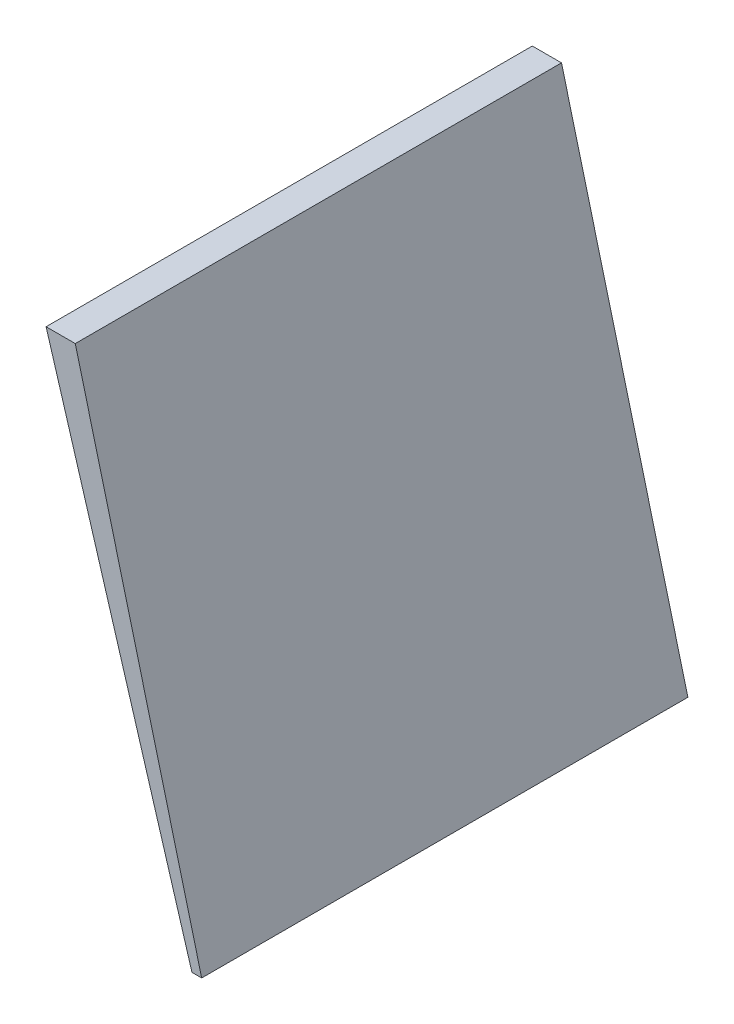
ISO-10303-21;
HEADER;
FILE_DESCRIPTION(('STEP AP214'),'2;1');
FILE_NAME('part.step','',(''),(''),'','','');
FILE_SCHEMA(('AUTOMOTIVE_DESIGN { 1 0 10303 214 1 1 1 1 }'));
ENDSEC;
DATA;
#1=APPLICATION_CONTEXT('core data for automotive mechanical design processes');
#2=APPLICATION_PROTOCOL_DEFINITION('international standard','automotive_design',2000,#1);
#3=PRODUCT_CONTEXT('',#1,'mechanical');
#4=PRODUCT('Part','Part','',(#3));
#5=PRODUCT_RELATED_PRODUCT_CATEGORY('part','',(#4));
#6=PRODUCT_DEFINITION_FORMATION('','',#4);
#7=PRODUCT_DEFINITION_CONTEXT('part definition',#1,'design');
#8=PRODUCT_DEFINITION('design','',#6,#7);
#9=PRODUCT_DEFINITION_SHAPE('','',#8);
#10=(LENGTH_UNIT() NAMED_UNIT(*) SI_UNIT(.MILLI.,.METRE.));
#11=(NAMED_UNIT(*) PLANE_ANGLE_UNIT() SI_UNIT($,.RADIAN.));
#12=(NAMED_UNIT(*) SI_UNIT($,.STERADIAN.) SOLID_ANGLE_UNIT());
#13=UNCERTAINTY_MEASURE_WITH_UNIT(LENGTH_MEASURE(1.E-05),#10,'distance_accuracy_value','');
#14=(GEOMETRIC_REPRESENTATION_CONTEXT(3) GLOBAL_UNCERTAINTY_ASSIGNED_CONTEXT((#13)) GLOBAL_UNIT_ASSIGNED_CONTEXT((#10,
#11,#12)) REPRESENTATION_CONTEXT('',''));
#15=CARTESIAN_POINT('',(0.,0.,0.));
#16=DIRECTION('',(0.,0.,1.));
#17=DIRECTION('',(1.,0.,0.));
#18=AXIS2_PLACEMENT_3D('',#15,#16,#17);
#19=CARTESIAN_POINT('',(-75.91791907794,-2.126384400507,-48.45331843764));
#20=DIRECTION('',(-0.967822506789037,-0.25163385176201,0.));
#21=DIRECTION('',(0.25163385176201,-0.967822506789037,0.));
#22=AXIS2_PLACEMENT_3D('',#19,#20,#21);
#23=PLANE('',#22);
#24=DIRECTION('',(0.251633851761432,-0.967822506789187,0.));
#25=VECTOR('',#24,1.);
#26=CARTESIAN_POINT('',(-76.04791907793,-1.626384400547,-47.25331843764));
#27=LINE('',#26,#25);
#28=CARTESIAN_POINT('',(-76.0479190779294,-1.62638440054749,-47.25331843764));
#29=VERTEX_POINT('',#28);
#30=CARTESIAN_POINT('',(-75.9179190779389,-2.12638440051797,-47.25331843764));
#31=VERTEX_POINT('',#30);
#32=EDGE_CURVE('E66',#29,#31,#27,.T.);
#33=ORIENTED_EDGE('',*,*,#32,.F.);
#34=DIRECTION('',(0.,0.,-1.));
#35=VECTOR('',#34,1.);
#36=CARTESIAN_POINT('',(-76.04791907793,-1.626384400547,-47.92363973764));
#37=LINE('',#36,#35);
#38=CARTESIAN_POINT('',(-76.0479190779269,-1.62638440054749,-46.75331973764));
#39=VERTEX_POINT('',#38);
#40=EDGE_CURVE('E19',#29,#39,#37,.F.);
#41=ORIENTED_EDGE('',*,*,#40,.T.);
#42=DIRECTION('',(-0.25163385174329,0.967822506793904,0.));
#43=VECTOR('',#42,1.);
#44=CARTESIAN_POINT('',(-75.91791907794,-2.126384400516,-46.75331973764));
#45=LINE('',#44,#43);
#46=CARTESIAN_POINT('',(-75.9179190779395,-2.12638440052036,-46.75331973764));
#47=VERTEX_POINT('',#46);
#48=EDGE_CURVE('E80',#47,#39,#45,.T.);
#49=ORIENTED_EDGE('',*,*,#48,.F.);
#50=DIRECTION('',(0.,0.,1.));
#51=VECTOR('',#50,1.);
#52=CARTESIAN_POINT('',(-75.91791907794,-2.126384400525,-44.48106509227));
#53=LINE('',#52,#51);
#54=EDGE_CURVE('E54',#47,#31,#53,.F.);
#55=ORIENTED_EDGE('',*,*,#54,.T.);
#56=EDGE_LOOP('',(#33,#41,#49,#55));
#57=FACE_BOUND('',#56,.T.);
#58=ADVANCED_FACE('F16',(#57),#23,.F.);
#59=CARTESIAN_POINT('',(-66.69522532924,-1.626384400547,-47.92363973764));
#60=DIRECTION('',(0.,-1.,0.));
#61=DIRECTION('',(0.,0.,-1.));
#62=AXIS2_PLACEMENT_3D('',#59,#60,#61);
#63=PLANE('',#62);
#64=DIRECTION('',(-1.,0.,0.));
#65=VECTOR('',#64,1.);
#66=CARTESIAN_POINT('',(0.,-1.626384400547,-47.25331843764));
#67=LINE('',#66,#65);
#68=CARTESIAN_POINT('',(-76.0779190779301,-1.62638440054703,-47.25331843764));
#69=VERTEX_POINT('',#68);
#70=EDGE_CURVE('E61',#69,#29,#67,.F.);
#71=ORIENTED_EDGE('',*,*,#70,.F.);
#72=DIRECTION('',(0.,0.,1.));
#73=VECTOR('',#72,1.);
#74=CARTESIAN_POINT('',(-76.0779190779304,-1.62638440054712,-47.92363973764));
#75=LINE('',#74,#73);
#76=CARTESIAN_POINT('',(-76.0779190779301,-1.62638440054703,-46.75331973764));
#77=VERTEX_POINT('',#76);
#78=EDGE_CURVE('E82',#77,#69,#75,.F.);
#79=ORIENTED_EDGE('',*,*,#78,.F.);
#80=DIRECTION('',(1.,0.,0.));
#81=VECTOR('',#80,1.);
#82=CARTESIAN_POINT('',(-68.59999366419,-1.626384400547,-46.75331973764));
#83=LINE('',#82,#81);
#84=EDGE_CURVE('E64',#39,#77,#83,.F.);
#85=ORIENTED_EDGE('',*,*,#84,.F.);
#86=ORIENTED_EDGE('',*,*,#40,.F.);
#87=EDGE_LOOP('',(#71,#79,#85,#86));
#88=FACE_BOUND('',#87,.T.);
#89=ADVANCED_FACE('F59',(#88),#63,.F.);
#90=CARTESIAN_POINT('',(0.,0.,-47.25331843764));
#91=DIRECTION('',(0.,0.,-1.));
#92=DIRECTION('',(-1.,0.,0.));
#93=AXIS2_PLACEMENT_3D('',#90,#91,#92);
#94=PLANE('',#93);
#95=DIRECTION('',(1.,0.,0.));
#96=VECTOR('',#95,1.);
#97=CARTESIAN_POINT('',(-72.08658338126,-2.126384400525,-47.25331843764));
#98=LINE('',#97,#96);
#99=CARTESIAN_POINT('',(-75.92791907794,-2.12638440051824,-47.25331843764));
#100=VERTEX_POINT('',#99);
#101=EDGE_CURVE('E76',#31,#100,#98,.F.);
#102=ORIENTED_EDGE('',*,*,#101,.T.);
#103=DIRECTION('',(0.28734788556607,-0.957826285221234,0.));
#104=VECTOR('',#103,1.);
#105=CARTESIAN_POINT('',(-75.91240229211,-2.178107019949,-47.25331843764));
#106=LINE('',#105,#104);
#107=EDGE_CURVE('E72',#69,#100,#106,.T.);
#108=ORIENTED_EDGE('',*,*,#107,.F.);
#109=ORIENTED_EDGE('',*,*,#70,.T.);
#110=ORIENTED_EDGE('',*,*,#32,.T.);
#111=EDGE_LOOP('',(#102,#108,#109,#110));
#112=FACE_BOUND('',#111,.T.);
#113=ADVANCED_FACE('F70',(#112),#94,.T.);
#114=CARTESIAN_POINT('',(-72.08658338126,-2.126384400525,-44.48106509227));
#115=DIRECTION('',(0.,1.,0.));
#116=DIRECTION('',(0.,0.,1.));
#117=AXIS2_PLACEMENT_3D('',#114,#115,#116);
#118=PLANE('',#117);
#119=DIRECTION('',(0.,0.,1.));
#120=VECTOR('',#119,1.);
#121=CARTESIAN_POINT('',(-75.9279190779399,-2.12638440051597,-47.92363973764));
#122=LINE('',#121,#120);
#123=CARTESIAN_POINT('',(-75.92791907794,-2.12638440052049,-46.75331973764));
#124=VERTEX_POINT('',#123);
#125=EDGE_CURVE('E25',#100,#124,#122,.T.);
#126=ORIENTED_EDGE('',*,*,#125,.F.);
#127=ORIENTED_EDGE('',*,*,#101,.F.);
#128=ORIENTED_EDGE('',*,*,#54,.F.);
#129=DIRECTION('',(1.,0.,0.));
#130=VECTOR('',#129,1.);
#131=CARTESIAN_POINT('',(-68.59999366419,-2.126384400516,-46.75331973764));
#132=LINE('',#131,#130);
#133=EDGE_CURVE('E34',#124,#47,#132,.T.);
#134=ORIENTED_EDGE('',*,*,#133,.F.);
#135=EDGE_LOOP('',(#126,#127,#128,#134));
#136=FACE_BOUND('',#135,.T.);
#137=ADVANCED_FACE('F88',(#136),#118,.F.);
#138=CARTESIAN_POINT('',(-68.59999366419,-2.201384400604,-46.75331973764));
#139=DIRECTION('',(0.,0.,1.));
#140=DIRECTION('',(1.,0.,0.));
#141=AXIS2_PLACEMENT_3D('',#138,#139,#140);
#142=PLANE('',#141);
#143=ORIENTED_EDGE('',*,*,#133,.T.);
#144=ORIENTED_EDGE('',*,*,#48,.T.);
#145=ORIENTED_EDGE('',*,*,#84,.T.);
#146=DIRECTION('',(0.28734788556607,-0.957826285221234,0.));
#147=VECTOR('',#146,1.);
#148=CARTESIAN_POINT('',(-75.91240229211,-2.178107019949,-46.75331973764));
#149=LINE('',#148,#147);
#150=EDGE_CURVE('E11',#124,#77,#149,.F.);
#151=ORIENTED_EDGE('',*,*,#150,.F.);
#152=EDGE_LOOP('',(#143,#144,#145,#151));
#153=FACE_BOUND('',#152,.T.);
#154=ADVANCED_FACE('F90',(#153),#142,.T.);
#155=CARTESIAN_POINT('',(-75.91240229211,-2.178107019949,-47.92363973764));
#156=DIRECTION('',(-0.957826285221234,-0.28734788556607,0.));
#157=DIRECTION('',(0.28734788556607,-0.957826285221234,0.));
#158=AXIS2_PLACEMENT_3D('',#155,#156,#157);
#159=PLANE('',#158);
#160=ORIENTED_EDGE('',*,*,#125,.T.);
#161=ORIENTED_EDGE('',*,*,#150,.T.);
#162=ORIENTED_EDGE('',*,*,#78,.T.);
#163=ORIENTED_EDGE('',*,*,#107,.T.);
#164=EDGE_LOOP('',(#160,#161,#162,#163));
#165=FACE_BOUND('',#164,.T.);
#166=ADVANCED_FACE('F87',(#165),#159,.T.);
#167=CLOSED_SHELL('',(#58,#89,#113,#137,#154,#166));
#168=MANIFOLD_SOLID_BREP('B1',#167);
#169=ADVANCED_BREP_SHAPE_REPRESENTATION('',(#18,#168),#14);
#170=SHAPE_DEFINITION_REPRESENTATION(#9,#169);
ENDSEC;
END-ISO-10303-21;
